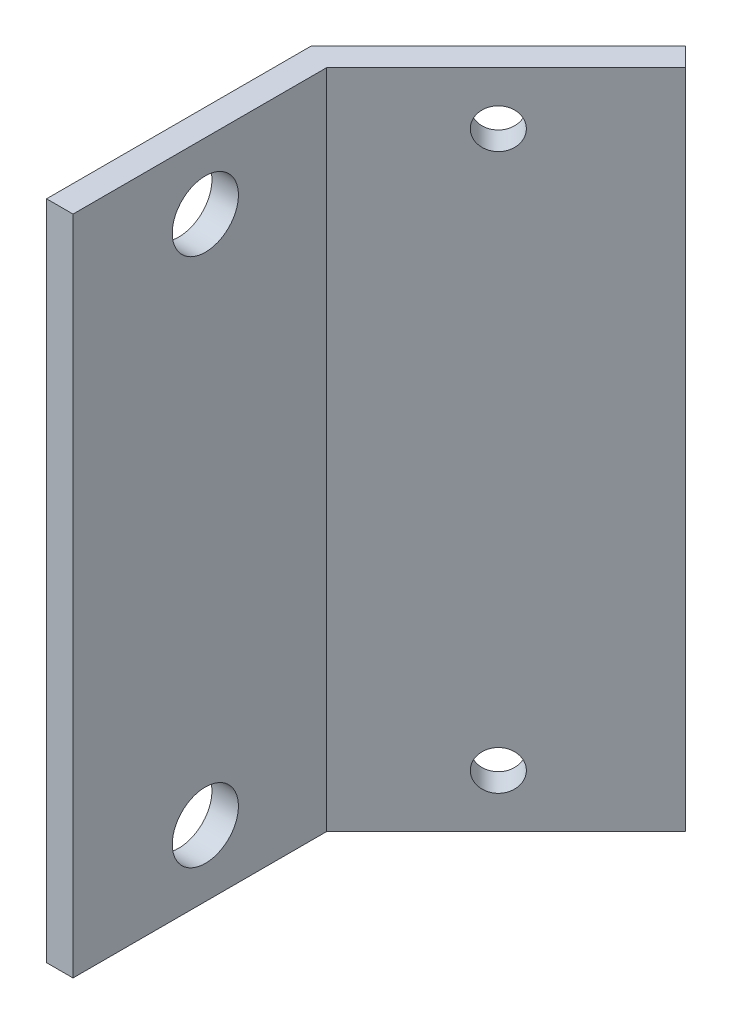
ISO-10303-21;
HEADER;
FILE_DESCRIPTION(('STEP AP214'),'2;1');
FILE_NAME('part.step','',(''),(''),'','','');
FILE_SCHEMA(('AUTOMOTIVE_DESIGN { 1 0 10303 214 1 1 1 1 }'));
ENDSEC;
DATA;
#1=APPLICATION_CONTEXT('core data for automotive mechanical design processes');
#2=APPLICATION_PROTOCOL_DEFINITION('international standard','automotive_design',2000,#1);
#3=PRODUCT_CONTEXT('',#1,'mechanical');
#4=PRODUCT('Part','Part','',(#3));
#5=PRODUCT_RELATED_PRODUCT_CATEGORY('part','',(#4));
#6=PRODUCT_DEFINITION_FORMATION('','',#4);
#7=PRODUCT_DEFINITION_CONTEXT('part definition',#1,'design');
#8=PRODUCT_DEFINITION('design','',#6,#7);
#9=PRODUCT_DEFINITION_SHAPE('','',#8);
#10=(LENGTH_UNIT() NAMED_UNIT(*) SI_UNIT(.MILLI.,.METRE.));
#11=(NAMED_UNIT(*) PLANE_ANGLE_UNIT() SI_UNIT($,.RADIAN.));
#12=(NAMED_UNIT(*) SI_UNIT($,.STERADIAN.) SOLID_ANGLE_UNIT());
#13=UNCERTAINTY_MEASURE_WITH_UNIT(LENGTH_MEASURE(1.E-05),#10,'distance_accuracy_value','');
#14=(GEOMETRIC_REPRESENTATION_CONTEXT(3) GLOBAL_UNCERTAINTY_ASSIGNED_CONTEXT((#13)) GLOBAL_UNIT_ASSIGNED_CONTEXT((#10,
#11,#12)) REPRESENTATION_CONTEXT('',''));
#15=CARTESIAN_POINT('',(0.,0.,0.));
#16=DIRECTION('',(0.,0.,1.));
#17=DIRECTION('',(1.,0.,0.));
#18=AXIS2_PLACEMENT_3D('',#15,#16,#17);
#19=CARTESIAN_POINT('',(2.,50.,0.));
#20=DIRECTION('',(0.,0.,-1.));
#21=DIRECTION('',(-1.,0.,0.));
#22=AXIS2_PLACEMENT_3D('',#19,#20,#21);
#23=PLANE('',#22);
#24=DIRECTION('',(1.,0.,0.));
#25=VECTOR('',#24,1.);
#26=CARTESIAN_POINT('',(2.,0.,0.));
#27=LINE('',#26,#25);
#28=CARTESIAN_POINT('',(0.,0.,0.));
#29=VERTEX_POINT('',#28);
#30=CARTESIAN_POINT('',(2.,0.,0.));
#31=VERTEX_POINT('',#30);
#32=EDGE_CURVE('E115',#29,#31,#27,.T.);
#33=ORIENTED_EDGE('',*,*,#32,.T.);
#34=DIRECTION('',(0.,-1.,0.));
#35=VECTOR('',#34,1.);
#36=CARTESIAN_POINT('',(2.,50.,0.));
#37=LINE('',#36,#35);
#38=CARTESIAN_POINT('',(2.,50.,0.));
#39=VERTEX_POINT('',#38);
#40=EDGE_CURVE('E11',#39,#31,#37,.T.);
#41=ORIENTED_EDGE('',*,*,#40,.F.);
#42=DIRECTION('',(1.,0.,0.));
#43=VECTOR('',#42,1.);
#44=CARTESIAN_POINT('',(2.,50.,0.));
#45=LINE('',#44,#43);
#46=CARTESIAN_POINT('',(0.,50.,0.));
#47=VERTEX_POINT('',#46);
#48=EDGE_CURVE('E126',#47,#39,#45,.T.);
#49=ORIENTED_EDGE('',*,*,#48,.F.);
#50=DIRECTION('',(0.,-1.,0.));
#51=VECTOR('',#50,1.);
#52=CARTESIAN_POINT('',(0.,50.,0.));
#53=LINE('',#52,#51);
#54=EDGE_CURVE('E111',#47,#29,#53,.T.);
#55=ORIENTED_EDGE('',*,*,#54,.T.);
#56=EDGE_LOOP('',(#33,#41,#49,#55));
#57=FACE_BOUND('',#56,.T.);
#58=ADVANCED_FACE('F31',(#57),#23,.F.);
#59=CARTESIAN_POINT('',(2.,50.,-19.1715728752538));
#60=DIRECTION('',(-1.,0.,0.));
#61=DIRECTION('',(0.,0.,1.));
#62=AXIS2_PLACEMENT_3D('',#59,#60,#61);
#63=PLANE('',#62);
#64=CARTESIAN_POINT('',(2.,45.,-10.));
#65=DIRECTION('',(-1.,0.,0.));
#66=DIRECTION('',(0.,0.,1.));
#67=AXIS2_PLACEMENT_3D('',#64,#65,#66);
#68=CIRCLE('',#67,2.5);
#69=CARTESIAN_POINT('',(2.,45.,-7.50000000000001));
#70=VERTEX_POINT('',#69);
#71=EDGE_CURVE('E260',#70,#70,#68,.F.);
#72=ORIENTED_EDGE('',*,*,#71,.F.);
#73=EDGE_LOOP('',(#72));
#74=FACE_BOUND('',#73,.T.);
#75=CARTESIAN_POINT('',(2.,5.,-10.));
#76=DIRECTION('',(-1.,0.,0.));
#77=DIRECTION('',(0.,0.,1.));
#78=AXIS2_PLACEMENT_3D('',#75,#76,#77);
#79=CIRCLE('',#78,2.5);
#80=CARTESIAN_POINT('',(2.,5.,-7.5));
#81=VERTEX_POINT('',#80);
#82=EDGE_CURVE('E119',#81,#81,#79,.F.);
#83=ORIENTED_EDGE('',*,*,#82,.F.);
#84=EDGE_LOOP('',(#83));
#85=FACE_BOUND('',#84,.T.);
#86=DIRECTION('',(0.,0.,-1.));
#87=VECTOR('',#86,1.);
#88=CARTESIAN_POINT('',(2.,0.,-19.1715728752538));
#89=LINE('',#88,#87);
#90=CARTESIAN_POINT('',(2.,0.,-19.1715728752538));
#91=VERTEX_POINT('',#90);
#92=EDGE_CURVE('E118',#31,#91,#89,.T.);
#93=ORIENTED_EDGE('',*,*,#92,.T.);
#94=DIRECTION('',(0.,-1.,0.));
#95=VECTOR('',#94,1.);
#96=CARTESIAN_POINT('',(2.,50.,-19.1715728752538));
#97=LINE('',#96,#95);
#98=CARTESIAN_POINT('',(2.,50.,-19.1715728752538));
#99=VERTEX_POINT('',#98);
#100=EDGE_CURVE('E39',#99,#91,#97,.T.);
#101=ORIENTED_EDGE('',*,*,#100,.F.);
#102=DIRECTION('',(0.,0.,-1.));
#103=VECTOR('',#102,1.);
#104=CARTESIAN_POINT('',(2.,50.,-19.1715728752538));
#105=LINE('',#104,#103);
#106=EDGE_CURVE('E84',#39,#99,#105,.T.);
#107=ORIENTED_EDGE('',*,*,#106,.F.);
#108=ORIENTED_EDGE('',*,*,#40,.T.);
#109=EDGE_LOOP('',(#93,#101,#107,#108));
#110=FACE_BOUND('',#109,.T.);
#111=ADVANCED_FACE('F154',(#74,#85,#110),#63,.F.);
#112=CARTESIAN_POINT('',(15.5563491861041,50.,-32.7279220613578));
#113=DIRECTION('',(-0.707106781186546,0.,-0.707106781186549));
#114=DIRECTION('',(-0.707106781186549,0.,0.707106781186546));
#115=AXIS2_PLACEMENT_3D('',#112,#113,#114);
#116=PLANE('',#115);
#117=CARTESIAN_POINT('',(8.48528137423858,4.,-25.6568542494924));
#118=DIRECTION('',(-0.707106781186546,0.,-0.707106781186549));
#119=DIRECTION('',(-0.707106781186549,0.,0.707106781186546));
#120=AXIS2_PLACEMENT_3D('',#117,#118,#119);
#121=CIRCLE('',#120,1.5);
#122=CARTESIAN_POINT('',(7.42462120245876,4.,-24.5961940777125));
#123=VERTEX_POINT('',#122);
#124=EDGE_CURVE('E276',#123,#123,#121,.F.);
#125=ORIENTED_EDGE('',*,*,#124,.F.);
#126=EDGE_LOOP('',(#125));
#127=FACE_BOUND('',#126,.T.);
#128=CARTESIAN_POINT('',(8.48528137423857,46.,-25.6568542494924));
#129=DIRECTION('',(-0.707106781186546,0.,-0.707106781186549));
#130=DIRECTION('',(-0.707106781186549,0.,0.707106781186546));
#131=AXIS2_PLACEMENT_3D('',#128,#129,#130);
#132=CIRCLE('',#131,1.5);
#133=CARTESIAN_POINT('',(7.42462120245875,46.,-24.5961940777125));
#134=VERTEX_POINT('',#133);
#135=EDGE_CURVE('E270',#134,#134,#132,.F.);
#136=ORIENTED_EDGE('',*,*,#135,.F.);
#137=EDGE_LOOP('',(#136));
#138=FACE_BOUND('',#137,.T.);
#139=DIRECTION('',(0.707106781186549,0.,-0.707106781186546));
#140=VECTOR('',#139,1.);
#141=CARTESIAN_POINT('',(15.5563491861041,0.,-32.7279220613578));
#142=LINE('',#141,#140);
#143=CARTESIAN_POINT('',(15.5563491861041,0.,-32.7279220613578));
#144=VERTEX_POINT('',#143);
#145=EDGE_CURVE('E121',#91,#144,#142,.T.);
#146=ORIENTED_EDGE('',*,*,#145,.T.);
#147=DIRECTION('',(0.,-1.,0.));
#148=VECTOR('',#147,1.);
#149=CARTESIAN_POINT('',(15.5563491861041,50.,-32.7279220613578));
#150=LINE('',#149,#148);
#151=CARTESIAN_POINT('',(15.5563491861041,50.,-32.7279220613578));
#152=VERTEX_POINT('',#151);
#153=EDGE_CURVE('E106',#152,#144,#150,.T.);
#154=ORIENTED_EDGE('',*,*,#153,.F.);
#155=DIRECTION('',(0.707106781186549,0.,-0.707106781186546));
#156=VECTOR('',#155,1.);
#157=CARTESIAN_POINT('',(15.5563491861041,50.,-32.7279220613578));
#158=LINE('',#157,#156);
#159=EDGE_CURVE('E97',#99,#152,#158,.T.);
#160=ORIENTED_EDGE('',*,*,#159,.F.);
#161=ORIENTED_EDGE('',*,*,#100,.T.);
#162=EDGE_LOOP('',(#146,#154,#160,#161));
#163=FACE_BOUND('',#162,.T.);
#164=ADVANCED_FACE('F132',(#127,#138,#163),#116,.F.);
#165=CARTESIAN_POINT('',(14.142135623731,50.,-34.1421356237309));
#166=DIRECTION('',(-0.707106781186549,0.,0.707106781186546));
#167=DIRECTION('',(0.707106781186546,0.,0.707106781186549));
#168=AXIS2_PLACEMENT_3D('',#165,#166,#167);
#169=PLANE('',#168);
#170=DIRECTION('',(-0.707106781186546,0.,-0.707106781186549));
#171=VECTOR('',#170,1.);
#172=CARTESIAN_POINT('',(14.142135623731,0.,-34.1421356237309));
#173=LINE('',#172,#171);
#174=CARTESIAN_POINT('',(14.142135623731,0.,-34.1421356237309));
#175=VERTEX_POINT('',#174);
#176=EDGE_CURVE('E105',#144,#175,#173,.T.);
#177=ORIENTED_EDGE('',*,*,#176,.T.);
#178=DIRECTION('',(0.,-1.,0.));
#179=VECTOR('',#178,1.);
#180=CARTESIAN_POINT('',(14.142135623731,50.,-34.1421356237309));
#181=LINE('',#180,#179);
#182=CARTESIAN_POINT('',(14.142135623731,50.,-34.1421356237309));
#183=VERTEX_POINT('',#182);
#184=EDGE_CURVE('E102',#183,#175,#181,.T.);
#185=ORIENTED_EDGE('',*,*,#184,.F.);
#186=DIRECTION('',(-0.707106781186546,0.,-0.707106781186549));
#187=VECTOR('',#186,1.);
#188=CARTESIAN_POINT('',(14.142135623731,50.,-34.1421356237309));
#189=LINE('',#188,#187);
#190=EDGE_CURVE('E91',#152,#183,#189,.T.);
#191=ORIENTED_EDGE('',*,*,#190,.F.);
#192=ORIENTED_EDGE('',*,*,#153,.T.);
#193=EDGE_LOOP('',(#177,#185,#191,#192));
#194=FACE_BOUND('',#193,.T.);
#195=ADVANCED_FACE('F103',(#194),#169,.F.);
#196=CARTESIAN_POINT('',(0.,50.,-20.));
#197=DIRECTION('',(0.707106781186546,0.,0.707106781186549));
#198=DIRECTION('',(0.707106781186549,0.,-0.707106781186546));
#199=AXIS2_PLACEMENT_3D('',#196,#197,#198);
#200=PLANE('',#199);
#201=CARTESIAN_POINT('',(7.07106781186548,4.,-27.0710678118655));
#202=DIRECTION('',(-0.707106781186546,0.,-0.707106781186549));
#203=DIRECTION('',(0.707106781186549,0.,-0.707106781186546));
#204=AXIS2_PLACEMENT_3D('',#201,#202,#203);
#205=CIRCLE('',#204,1.5);
#206=CARTESIAN_POINT('',(8.13172798364531,4.,-28.1317279836453));
#207=VERTEX_POINT('',#206);
#208=EDGE_CURVE('E279',#207,#207,#205,.T.);
#209=ORIENTED_EDGE('',*,*,#208,.F.);
#210=EDGE_LOOP('',(#209));
#211=FACE_BOUND('',#210,.T.);
#212=CARTESIAN_POINT('',(7.07106781186548,46.,-27.0710678118655));
#213=DIRECTION('',(-0.707106781186546,0.,-0.707106781186549));
#214=DIRECTION('',(-0.707106781186549,0.,0.707106781186546));
#215=AXIS2_PLACEMENT_3D('',#212,#213,#214);
#216=CIRCLE('',#215,1.5);
#217=CARTESIAN_POINT('',(6.01040764008565,46.,-26.0104076400856));
#218=VERTEX_POINT('',#217);
#219=EDGE_CURVE('E273',#218,#218,#216,.T.);
#220=ORIENTED_EDGE('',*,*,#219,.F.);
#221=EDGE_LOOP('',(#220));
#222=FACE_BOUND('',#221,.T.);
#223=DIRECTION('',(-0.707106781186549,0.,0.707106781186546));
#224=VECTOR('',#223,1.);
#225=CARTESIAN_POINT('',(0.,0.,-20.));
#226=LINE('',#225,#224);
#227=CARTESIAN_POINT('',(0.,0.,-20.));
#228=VERTEX_POINT('',#227);
#229=EDGE_CURVE('E70',#175,#228,#226,.T.);
#230=ORIENTED_EDGE('',*,*,#229,.T.);
#231=DIRECTION('',(0.,-1.,0.));
#232=VECTOR('',#231,1.);
#233=CARTESIAN_POINT('',(0.,50.,-20.));
#234=LINE('',#233,#232);
#235=CARTESIAN_POINT('',(0.,50.,-20.));
#236=VERTEX_POINT('',#235);
#237=EDGE_CURVE('E107',#236,#228,#234,.T.);
#238=ORIENTED_EDGE('',*,*,#237,.F.);
#239=DIRECTION('',(-0.707106781186549,0.,0.707106781186546));
#240=VECTOR('',#239,1.);
#241=CARTESIAN_POINT('',(0.,50.,-20.));
#242=LINE('',#241,#240);
#243=EDGE_CURVE('E95',#183,#236,#242,.T.);
#244=ORIENTED_EDGE('',*,*,#243,.F.);
#245=ORIENTED_EDGE('',*,*,#184,.T.);
#246=EDGE_LOOP('',(#230,#238,#244,#245));
#247=FACE_BOUND('',#246,.T.);
#248=ADVANCED_FACE('F109',(#211,#222,#247),#200,.F.);
#249=CARTESIAN_POINT('',(0.,50.,0.));
#250=DIRECTION('',(1.,0.,0.));
#251=DIRECTION('',(0.,0.,-1.));
#252=AXIS2_PLACEMENT_3D('',#249,#250,#251);
#253=PLANE('',#252);
#254=CARTESIAN_POINT('',(0.,45.,-10.));
#255=DIRECTION('',(-1.,0.,0.));
#256=DIRECTION('',(0.,0.,-1.));
#257=AXIS2_PLACEMENT_3D('',#254,#255,#256);
#258=CIRCLE('',#257,2.5);
#259=CARTESIAN_POINT('',(0.,45.,-12.5));
#260=VERTEX_POINT('',#259);
#261=EDGE_CURVE('E267',#260,#260,#258,.T.);
#262=ORIENTED_EDGE('',*,*,#261,.F.);
#263=EDGE_LOOP('',(#262));
#264=FACE_BOUND('',#263,.T.);
#265=CARTESIAN_POINT('',(0.,5.,-10.));
#266=DIRECTION('',(-1.,0.,0.));
#267=DIRECTION('',(0.,0.,1.));
#268=AXIS2_PLACEMENT_3D('',#265,#266,#267);
#269=CIRCLE('',#268,2.5);
#270=CARTESIAN_POINT('',(0.,5.,-7.5));
#271=VERTEX_POINT('',#270);
#272=EDGE_CURVE('E256',#271,#271,#269,.T.);
#273=ORIENTED_EDGE('',*,*,#272,.F.);
#274=EDGE_LOOP('',(#273));
#275=FACE_BOUND('',#274,.T.);
#276=DIRECTION('',(0.,0.,1.));
#277=VECTOR('',#276,1.);
#278=CARTESIAN_POINT('',(0.,0.,0.));
#279=LINE('',#278,#277);
#280=EDGE_CURVE('E76',#228,#29,#279,.T.);
#281=ORIENTED_EDGE('',*,*,#280,.T.);
#282=ORIENTED_EDGE('',*,*,#54,.F.);
#283=DIRECTION('',(0.,0.,1.));
#284=VECTOR('',#283,1.);
#285=CARTESIAN_POINT('',(0.,50.,0.));
#286=LINE('',#285,#284);
#287=EDGE_CURVE('E47',#236,#47,#286,.T.);
#288=ORIENTED_EDGE('',*,*,#287,.F.);
#289=ORIENTED_EDGE('',*,*,#237,.T.);
#290=EDGE_LOOP('',(#281,#282,#288,#289));
#291=FACE_BOUND('',#290,.T.);
#292=ADVANCED_FACE('F139',(#264,#275,#291),#253,.F.);
#293=CARTESIAN_POINT('',(0.,50.,0.));
#294=DIRECTION('',(0.,-1.,0.));
#295=DIRECTION('',(0.,0.,-1.));
#296=AXIS2_PLACEMENT_3D('',#293,#294,#295);
#297=PLANE('',#296);
#298=ORIENTED_EDGE('',*,*,#48,.T.);
#299=ORIENTED_EDGE('',*,*,#106,.T.);
#300=ORIENTED_EDGE('',*,*,#159,.T.);
#301=ORIENTED_EDGE('',*,*,#190,.T.);
#302=ORIENTED_EDGE('',*,*,#243,.T.);
#303=ORIENTED_EDGE('',*,*,#287,.T.);
#304=EDGE_LOOP('',(#298,#299,#300,#301,#302,#303));
#305=FACE_BOUND('',#304,.T.);
#306=ADVANCED_FACE('F93',(#305),#297,.F.);
#307=CARTESIAN_POINT('',(0.,0.,0.));
#308=DIRECTION('',(0.,-1.,0.));
#309=DIRECTION('',(0.,0.,-1.));
#310=AXIS2_PLACEMENT_3D('',#307,#308,#309);
#311=PLANE('',#310);
#312=ORIENTED_EDGE('',*,*,#32,.F.);
#313=ORIENTED_EDGE('',*,*,#280,.F.);
#314=ORIENTED_EDGE('',*,*,#229,.F.);
#315=ORIENTED_EDGE('',*,*,#176,.F.);
#316=ORIENTED_EDGE('',*,*,#145,.F.);
#317=ORIENTED_EDGE('',*,*,#92,.F.);
#318=EDGE_LOOP('',(#312,#313,#314,#315,#316,#317));
#319=FACE_BOUND('',#318,.T.);
#320=ADVANCED_FACE('F135',(#319),#311,.T.);
#321=CARTESIAN_POINT('',(15.5573491861041,5.,-10.));
#322=DIRECTION('',(-1.,0.,0.));
#323=DIRECTION('',(0.,0.,1.));
#324=AXIS2_PLACEMENT_3D('',#321,#322,#323);
#325=CYLINDRICAL_SURFACE('',#324,2.5);
#326=ORIENTED_EDGE('',*,*,#272,.T.);
#327=EDGE_LOOP('',(#326));
#328=FACE_BOUND('',#327,.T.);
#329=ORIENTED_EDGE('',*,*,#82,.T.);
#330=EDGE_LOOP('',(#329));
#331=FACE_BOUND('',#330,.T.);
#332=ADVANCED_FACE('F212',(#328,#331),#325,.F.);
#333=CARTESIAN_POINT('',(15.5573491861041,45.,-10.));
#334=DIRECTION('',(-1.,0.,0.));
#335=DIRECTION('',(0.,0.,1.));
#336=AXIS2_PLACEMENT_3D('',#333,#334,#335);
#337=CYLINDRICAL_SURFACE('',#336,2.5);
#338=ORIENTED_EDGE('',*,*,#261,.T.);
#339=EDGE_LOOP('',(#338));
#340=FACE_BOUND('',#339,.T.);
#341=ORIENTED_EDGE('',*,*,#71,.T.);
#342=EDGE_LOOP('',(#341));
#343=FACE_BOUND('',#342,.T.);
#344=ADVANCED_FACE('F192',(#340,#343),#337,.F.);
#345=CARTESIAN_POINT('',(24.8502424049175,46.,-9.29189321881339));
#346=DIRECTION('',(-0.707106781186546,0.,-0.707106781186549));
#347=DIRECTION('',(-0.707106781186549,0.,0.707106781186546));
#348=AXIS2_PLACEMENT_3D('',#345,#346,#347);
#349=CYLINDRICAL_SURFACE('',#348,1.5);
#350=ORIENTED_EDGE('',*,*,#219,.T.);
#351=EDGE_LOOP('',(#350));
#352=FACE_BOUND('',#351,.T.);
#353=ORIENTED_EDGE('',*,*,#135,.T.);
#354=EDGE_LOOP('',(#353));
#355=FACE_BOUND('',#354,.T.);
#356=ADVANCED_FACE('F186',(#352,#355),#349,.F.);
#357=CARTESIAN_POINT('',(24.8502424049175,4.,-9.29189321881339));
#358=DIRECTION('',(-0.707106781186546,0.,-0.707106781186549));
#359=DIRECTION('',(-0.707106781186549,0.,0.707106781186546));
#360=AXIS2_PLACEMENT_3D('',#357,#358,#359);
#361=CYLINDRICAL_SURFACE('',#360,1.5);
#362=ORIENTED_EDGE('',*,*,#208,.T.);
#363=EDGE_LOOP('',(#362));
#364=FACE_BOUND('',#363,.T.);
#365=ORIENTED_EDGE('',*,*,#124,.T.);
#366=EDGE_LOOP('',(#365));
#367=FACE_BOUND('',#366,.T.);
#368=ADVANCED_FACE('F191',(#364,#367),#361,.F.);
#369=CLOSED_SHELL('',(#58,#111,#164,#195,#248,#292,#306,#320,#332,#344,#356,#368));
#370=MANIFOLD_SOLID_BREP('B2',#369);
#371=ADVANCED_BREP_SHAPE_REPRESENTATION('',(#18,#370),#14);
#372=SHAPE_DEFINITION_REPRESENTATION(#9,#371);
ENDSEC;
END-ISO-10303-21;
